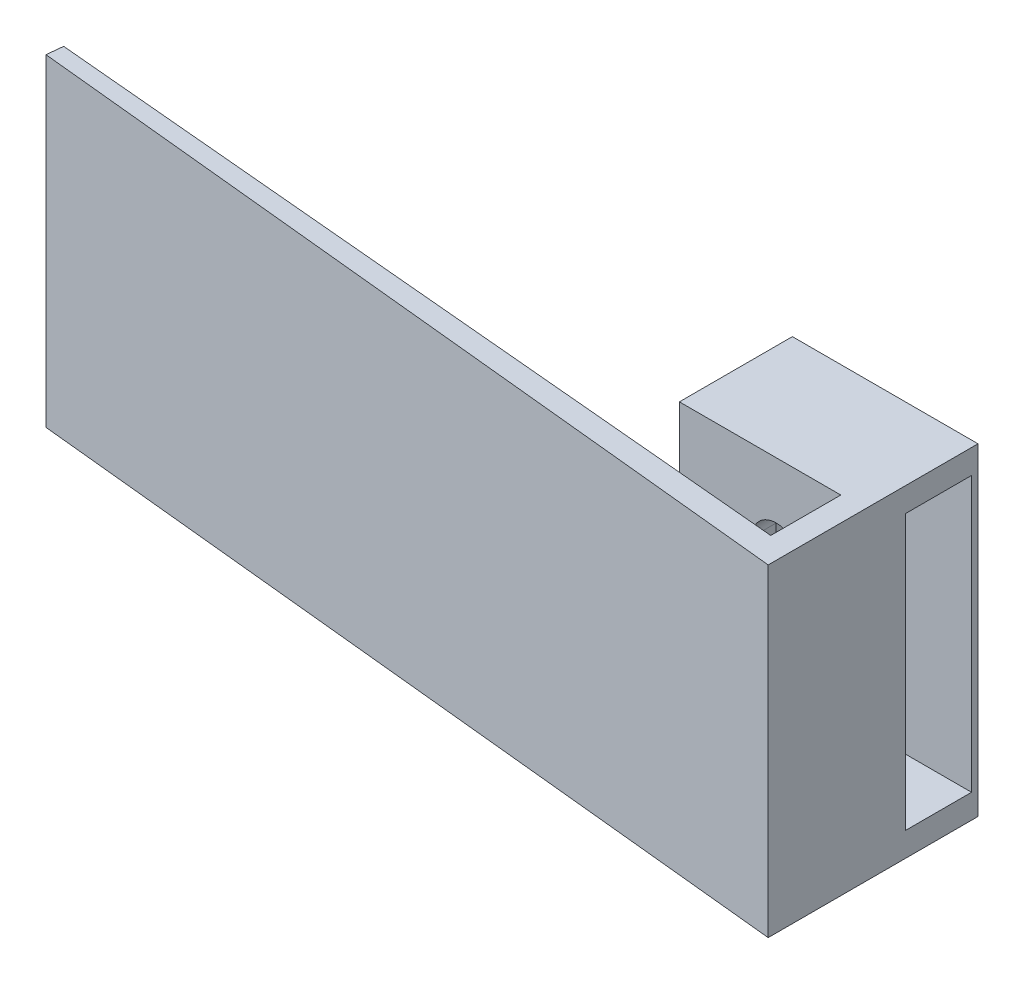
ISO-10303-21;
HEADER;
FILE_DESCRIPTION(('STEP AP214'),'2;1');
FILE_NAME('part.step','',(''),(''),'','','');
FILE_SCHEMA(('AUTOMOTIVE_DESIGN { 1 0 10303 214 1 1 1 1 }'));
ENDSEC;
DATA;
#1=APPLICATION_CONTEXT('core data for automotive mechanical design processes');
#2=APPLICATION_PROTOCOL_DEFINITION('international standard','automotive_design',2000,#1);
#3=PRODUCT_CONTEXT('',#1,'mechanical');
#4=PRODUCT('Part','Part','',(#3));
#5=PRODUCT_RELATED_PRODUCT_CATEGORY('part','',(#4));
#6=PRODUCT_DEFINITION_FORMATION('','',#4);
#7=PRODUCT_DEFINITION_CONTEXT('part definition',#1,'design');
#8=PRODUCT_DEFINITION('design','',#6,#7);
#9=PRODUCT_DEFINITION_SHAPE('','',#8);
#10=(LENGTH_UNIT() NAMED_UNIT(*) SI_UNIT(.MILLI.,.METRE.));
#11=(NAMED_UNIT(*) PLANE_ANGLE_UNIT() SI_UNIT($,.RADIAN.));
#12=(NAMED_UNIT(*) SI_UNIT($,.STERADIAN.) SOLID_ANGLE_UNIT());
#13=UNCERTAINTY_MEASURE_WITH_UNIT(LENGTH_MEASURE(1.E-05),#10,'distance_accuracy_value','');
#14=(GEOMETRIC_REPRESENTATION_CONTEXT(3) GLOBAL_UNCERTAINTY_ASSIGNED_CONTEXT((#13)) GLOBAL_UNIT_ASSIGNED_CONTEXT((#10,
#11,#12)) REPRESENTATION_CONTEXT('',''));
#15=CARTESIAN_POINT('',(0.,0.,0.));
#16=DIRECTION('',(0.,0.,1.));
#17=DIRECTION('',(1.,0.,0.));
#18=AXIS2_PLACEMENT_3D('',#15,#16,#17);
#19=CARTESIAN_POINT('',(0.,18.5,-7.5));
#20=DIRECTION('',(0.,1.,0.));
#21=DIRECTION('',(-1.,0.,0.));
#22=AXIS2_PLACEMENT_3D('',#19,#20,#21);
#23=PLANE('',#22);
#24=DIRECTION('',(1.,0.,0.));
#25=VECTOR('',#24,1.);
#26=CARTESIAN_POINT('',(-9.50000000013552,18.5000000000173,-12.6));
#27=LINE('',#26,#25);
#28=CARTESIAN_POINT('',(-9.5,18.5000000000173,-12.6));
#29=VERTEX_POINT('',#28);
#30=CARTESIAN_POINT('',(0.,18.5000000000173,-12.6));
#31=VERTEX_POINT('',#30);
#32=EDGE_CURVE('E162',#29,#31,#27,.T.);
#33=ORIENTED_EDGE('',*,*,#32,.T.);
#34=DIRECTION('',(0.,0.,-1.));
#35=VECTOR('',#34,1.);
#36=CARTESIAN_POINT('',(0.,18.5,-8.5));
#37=LINE('',#36,#35);
#38=CARTESIAN_POINT('',(0.,18.5,-8.5));
#39=VERTEX_POINT('',#38);
#40=EDGE_CURVE('E174',#39,#31,#37,.T.);
#41=ORIENTED_EDGE('',*,*,#40,.F.);
#42=DIRECTION('',(1.,0.,0.));
#43=VECTOR('',#42,1.);
#44=CARTESIAN_POINT('',(0.,18.5,-8.5));
#45=LINE('',#44,#43);
#46=CARTESIAN_POINT('',(-1.5,18.5,-8.5));
#47=VERTEX_POINT('',#46);
#48=EDGE_CURVE('E352',#47,#39,#45,.T.);
#49=ORIENTED_EDGE('',*,*,#48,.F.);
#50=DIRECTION('',(0.,0.,-1.));
#51=VECTOR('',#50,1.);
#52=CARTESIAN_POINT('',(-1.5,18.5,-7.5));
#53=LINE('',#52,#51);
#54=CARTESIAN_POINT('',(-1.5,18.5,-7.5));
#55=VERTEX_POINT('',#54);
#56=EDGE_CURVE('E200',#55,#47,#53,.T.);
#57=ORIENTED_EDGE('',*,*,#56,.F.);
#58=DIRECTION('',(1.,0.,0.));
#59=VECTOR('',#58,1.);
#60=CARTESIAN_POINT('',(0.,18.5,-7.5));
#61=LINE('',#60,#59);
#62=CARTESIAN_POINT('',(-9.5,18.5,-7.5));
#63=VERTEX_POINT('',#62);
#64=EDGE_CURVE('E196',#63,#55,#61,.T.);
#65=ORIENTED_EDGE('',*,*,#64,.F.);
#66=DIRECTION('',(0.,0.,-1.));
#67=VECTOR('',#66,1.);
#68=CARTESIAN_POINT('',(-9.5,18.5,-7.5));
#69=LINE('',#68,#67);
#70=EDGE_CURVE('E177',#63,#29,#69,.T.);
#71=ORIENTED_EDGE('',*,*,#70,.T.);
#72=EDGE_LOOP('',(#33,#41,#49,#57,#65,#71));
#73=FACE_BOUND('',#72,.T.);
#74=ADVANCED_FACE('F33',(#73),#23,.F.);
#75=CARTESIAN_POINT('',(-9.5,0.,-7.5));
#76=DIRECTION('',(-1.,0.,0.));
#77=DIRECTION('',(0.,0.,1.));
#78=AXIS2_PLACEMENT_3D('',#75,#76,#77);
#79=PLANE('',#78);
#80=DIRECTION('',(0.,-1.,0.));
#81=VECTOR('',#80,1.);
#82=CARTESIAN_POINT('',(-9.49999999991869,500000.,-12.6));
#83=LINE('',#82,#81);
#84=CARTESIAN_POINT('',(-9.5,1.5,-12.6));
#85=VERTEX_POINT('',#84);
#86=EDGE_CURVE('E170',#29,#85,#83,.T.);
#87=ORIENTED_EDGE('',*,*,#86,.F.);
#88=ORIENTED_EDGE('',*,*,#70,.F.);
#89=DIRECTION('',(0.,1.,0.));
#90=VECTOR('',#89,1.);
#91=CARTESIAN_POINT('',(-9.5,0.,-7.5));
#92=LINE('',#91,#90);
#93=CARTESIAN_POINT('',(-9.5,1.5,-7.5));
#94=VERTEX_POINT('',#93);
#95=EDGE_CURVE('E193',#94,#63,#92,.T.);
#96=ORIENTED_EDGE('',*,*,#95,.F.);
#97=DIRECTION('',(0.,0.,-1.));
#98=VECTOR('',#97,1.);
#99=CARTESIAN_POINT('',(-9.5,1.5,-7.5));
#100=LINE('',#99,#98);
#101=EDGE_CURVE('E205',#94,#85,#100,.T.);
#102=ORIENTED_EDGE('',*,*,#101,.T.);
#103=EDGE_LOOP('',(#87,#88,#96,#102));
#104=FACE_BOUND('',#103,.T.);
#105=ADVANCED_FACE('F312',(#104),#79,.F.);
#106=CARTESIAN_POINT('',(0.,1.5,-7.5));
#107=DIRECTION('',(0.,1.,0.));
#108=DIRECTION('',(-1.,0.,0.));
#109=AXIS2_PLACEMENT_3D('',#106,#107,#108);
#110=PLANE('',#109);
#111=DIRECTION('',(0.,0.,-1.));
#112=VECTOR('',#111,1.);
#113=CARTESIAN_POINT('',(0.,1.5,-8.5));
#114=LINE('',#113,#112);
#115=CARTESIAN_POINT('',(0.,1.5,-8.5));
#116=VERTEX_POINT('',#115);
#117=CARTESIAN_POINT('',(0.,1.5,-12.6));
#118=VERTEX_POINT('',#117);
#119=EDGE_CURVE('E183',#116,#118,#114,.T.);
#120=ORIENTED_EDGE('',*,*,#119,.T.);
#121=DIRECTION('',(1.,0.,0.));
#122=VECTOR('',#121,1.);
#123=CARTESIAN_POINT('',(-9.5,1.5,-12.6));
#124=LINE('',#123,#122);
#125=EDGE_CURVE('E165',#85,#118,#124,.T.);
#126=ORIENTED_EDGE('',*,*,#125,.F.);
#127=ORIENTED_EDGE('',*,*,#101,.F.);
#128=DIRECTION('',(1.,0.,0.));
#129=VECTOR('',#128,1.);
#130=CARTESIAN_POINT('',(0.,1.5,-7.5));
#131=LINE('',#130,#129);
#132=CARTESIAN_POINT('',(-1.5,1.5,-7.5));
#133=VERTEX_POINT('',#132);
#134=EDGE_CURVE('E191',#94,#133,#131,.T.);
#135=ORIENTED_EDGE('',*,*,#134,.T.);
#136=DIRECTION('',(0.,0.,-1.));
#137=VECTOR('',#136,1.);
#138=CARTESIAN_POINT('',(-1.5,1.5,-7.5));
#139=LINE('',#138,#137);
#140=CARTESIAN_POINT('',(-1.5,1.5,-8.5));
#141=VERTEX_POINT('',#140);
#142=EDGE_CURVE('E199',#133,#141,#139,.T.);
#143=ORIENTED_EDGE('',*,*,#142,.T.);
#144=DIRECTION('',(1.,0.,0.));
#145=VECTOR('',#144,1.);
#146=CARTESIAN_POINT('',(0.,1.5,-8.5));
#147=LINE('',#146,#145);
#148=EDGE_CURVE('E184',#141,#116,#147,.T.);
#149=ORIENTED_EDGE('',*,*,#148,.T.);
#150=EDGE_LOOP('',(#120,#126,#127,#135,#143,#149));
#151=FACE_BOUND('',#150,.T.);
#152=ADVANCED_FACE('F317',(#151),#110,.T.);
#153=CARTESIAN_POINT('',(-11.5,20.,-13.));
#154=DIRECTION('',(0.,0.,-1.));
#155=DIRECTION('',(-1.,0.,0.));
#156=AXIS2_PLACEMENT_3D('',#153,#154,#155);
#157=PLANE('',#156);
#158=DIRECTION('',(0.,-1.,0.));
#159=VECTOR('',#158,1.);
#160=CARTESIAN_POINT('',(0.,20.,-13.));
#161=LINE('',#160,#159);
#162=CARTESIAN_POINT('',(0.,20.,-13.));
#163=VERTEX_POINT('',#162);
#164=CARTESIAN_POINT('',(0.,0.,-13.));
#165=VERTEX_POINT('',#164);
#166=EDGE_CURVE('E37',#163,#165,#161,.T.);
#167=ORIENTED_EDGE('',*,*,#166,.T.);
#168=DIRECTION('',(1.,0.,0.));
#169=VECTOR('',#168,1.);
#170=CARTESIAN_POINT('',(-11.5,0.,-13.));
#171=LINE('',#170,#169);
#172=CARTESIAN_POINT('',(-11.5,0.,-13.));
#173=VERTEX_POINT('',#172);
#174=EDGE_CURVE('E203',#173,#165,#171,.T.);
#175=ORIENTED_EDGE('',*,*,#174,.F.);
#176=DIRECTION('',(0.,-1.,0.));
#177=VECTOR('',#176,1.);
#178=CARTESIAN_POINT('',(-11.5,20.,-13.));
#179=LINE('',#178,#177);
#180=CARTESIAN_POINT('',(-11.5,20.,-13.));
#181=VERTEX_POINT('',#180);
#182=EDGE_CURVE('E11',#181,#173,#179,.T.);
#183=ORIENTED_EDGE('',*,*,#182,.F.);
#184=DIRECTION('',(1.,0.,0.));
#185=VECTOR('',#184,1.);
#186=CARTESIAN_POINT('',(-11.5,20.,-13.));
#187=LINE('',#186,#185);
#188=EDGE_CURVE('E210',#181,#163,#187,.T.);
#189=ORIENTED_EDGE('',*,*,#188,.T.);
#190=EDGE_LOOP('',(#167,#175,#183,#189));
#191=FACE_BOUND('',#190,.T.);
#192=ADVANCED_FACE('F35',(#191),#157,.T.);
#193=CARTESIAN_POINT('',(0.,20.,-13.));
#194=DIRECTION('',(1.,0.,0.));
#195=DIRECTION('',(0.,0.,-1.));
#196=AXIS2_PLACEMENT_3D('',#193,#194,#195);
#197=PLANE('',#196);
#198=DIRECTION('',(0.,0.,1.));
#199=VECTOR('',#198,1.);
#200=CARTESIAN_POINT('',(0.,0.,-13.));
#201=LINE('',#200,#199);
#202=CARTESIAN_POINT('',(0.,0.,0.));
#203=VERTEX_POINT('',#202);
#204=EDGE_CURVE('E237',#165,#203,#201,.T.);
#205=ORIENTED_EDGE('',*,*,#204,.F.);
#206=ORIENTED_EDGE('',*,*,#166,.F.);
#207=DIRECTION('',(0.,0.,1.));
#208=VECTOR('',#207,1.);
#209=CARTESIAN_POINT('',(0.,20.,-13.));
#210=LINE('',#209,#208);
#211=CARTESIAN_POINT('',(0.,20.,0.));
#212=VERTEX_POINT('',#211);
#213=EDGE_CURVE('E213',#163,#212,#210,.T.);
#214=ORIENTED_EDGE('',*,*,#213,.T.);
#215=DIRECTION('',(0.,-1.,0.));
#216=VECTOR('',#215,1.);
#217=CARTESIAN_POINT('',(0.,20.,0.));
#218=LINE('',#217,#216);
#219=EDGE_CURVE('E265',#212,#203,#218,.T.);
#220=ORIENTED_EDGE('',*,*,#219,.T.);
#221=EDGE_LOOP('',(#205,#206,#214,#220));
#222=FACE_BOUND('',#221,.T.);
#223=ORIENTED_EDGE('',*,*,#40,.T.);
#224=DIRECTION('',(0.,-1.,0.));
#225=VECTOR('',#224,1.);
#226=CARTESIAN_POINT('',(8.1314918990924E-11,500000.,-12.6));
#227=LINE('',#226,#225);
#228=EDGE_CURVE('E159',#31,#118,#227,.T.);
#229=ORIENTED_EDGE('',*,*,#228,.T.);
#230=ORIENTED_EDGE('',*,*,#119,.F.);
#231=DIRECTION('',(0.,-1.,0.));
#232=VECTOR('',#231,1.);
#233=CARTESIAN_POINT('',(0.,0.,-8.5));
#234=LINE('',#233,#232);
#235=EDGE_CURVE('E182',#39,#116,#234,.T.);
#236=ORIENTED_EDGE('',*,*,#235,.F.);
#237=EDGE_LOOP('',(#223,#229,#230,#236));
#238=FACE_BOUND('',#237,.T.);
#239=ADVANCED_FACE('F180',(#222,#238),#197,.T.);
#240=CARTESIAN_POINT('',(-1.5,0.,-7.5));
#241=DIRECTION('',(-1.,0.,0.));
#242=DIRECTION('',(0.,0.,1.));
#243=AXIS2_PLACEMENT_3D('',#240,#241,#242);
#244=PLANE('',#243);
#245=ORIENTED_EDGE('',*,*,#56,.T.);
#246=DIRECTION('',(0.,1.,0.));
#247=VECTOR('',#246,1.);
#248=CARTESIAN_POINT('',(-1.5,0.,-8.5));
#249=LINE('',#248,#247);
#250=EDGE_CURVE('E354',#141,#47,#249,.T.);
#251=ORIENTED_EDGE('',*,*,#250,.F.);
#252=ORIENTED_EDGE('',*,*,#142,.F.);
#253=DIRECTION('',(0.,1.,0.));
#254=VECTOR('',#253,1.);
#255=CARTESIAN_POINT('',(-1.5,0.,-7.5));
#256=LINE('',#255,#254);
#257=EDGE_CURVE('E186',#133,#55,#256,.T.);
#258=ORIENTED_EDGE('',*,*,#257,.T.);
#259=EDGE_LOOP('',(#245,#251,#252,#258));
#260=FACE_BOUND('',#259,.T.);
#261=ADVANCED_FACE('F308',(#260),#244,.T.);
#262=CARTESIAN_POINT('',(-11.5,20.,-6.));
#263=DIRECTION('',(-1.,0.,0.));
#264=DIRECTION('',(0.,0.,1.));
#265=AXIS2_PLACEMENT_3D('',#262,#263,#264);
#266=PLANE('',#265);
#267=DIRECTION('',(0.,0.,-1.));
#268=VECTOR('',#267,1.);
#269=CARTESIAN_POINT('',(-11.5,0.,-6.));
#270=LINE('',#269,#268);
#271=CARTESIAN_POINT('',(-11.5,0.,-6.));
#272=VERTEX_POINT('',#271);
#273=EDGE_CURVE('E214',#272,#173,#270,.T.);
#274=ORIENTED_EDGE('',*,*,#273,.F.);
#275=DIRECTION('',(0.,-1.,0.));
#276=VECTOR('',#275,1.);
#277=CARTESIAN_POINT('',(-11.5,20.,-6.));
#278=LINE('',#277,#276);
#279=CARTESIAN_POINT('',(-11.5,20.,-6.));
#280=VERTEX_POINT('',#279);
#281=EDGE_CURVE('E42',#280,#272,#278,.T.);
#282=ORIENTED_EDGE('',*,*,#281,.F.);
#283=DIRECTION('',(0.,0.,-1.));
#284=VECTOR('',#283,1.);
#285=CARTESIAN_POINT('',(-11.5,20.,-6.));
#286=LINE('',#285,#284);
#287=EDGE_CURVE('E232',#280,#181,#286,.T.);
#288=ORIENTED_EDGE('',*,*,#287,.T.);
#289=ORIENTED_EDGE('',*,*,#182,.T.);
#290=EDGE_LOOP('',(#274,#282,#288,#289));
#291=FACE_BOUND('',#290,.T.);
#292=ADVANCED_FACE('F278',(#291),#266,.T.);
#293=CARTESIAN_POINT('',(-1.5,20.,-6.));
#294=DIRECTION('',(0.,0.,1.));
#295=DIRECTION('',(1.,0.,0.));
#296=AXIS2_PLACEMENT_3D('',#293,#294,#295);
#297=PLANE('',#296);
#298=CARTESIAN_POINT('',(-5.5,15.,-6.));
#299=DIRECTION('',(0.,0.,1.));
#300=DIRECTION('',(1.,0.,0.));
#301=AXIS2_PLACEMENT_3D('',#298,#299,#300);
#302=CIRCLE('',#301,1.5);
#303=CARTESIAN_POINT('',(-7.,15.,-6.));
#304=VERTEX_POINT('',#303);
#305=CARTESIAN_POINT('',(-4.,15.,-6.));
#306=VERTEX_POINT('',#305);
#307=EDGE_CURVE('E377',#304,#306,#302,.F.);
#308=ORIENTED_EDGE('',*,*,#307,.T.);
#309=DIRECTION('',(0.,-1.,0.));
#310=VECTOR('',#309,1.);
#311=CARTESIAN_POINT('',(-4.,15.,-6.));
#312=LINE('',#311,#310);
#313=CARTESIAN_POINT('',(-4.,5.,-6.));
#314=VERTEX_POINT('',#313);
#315=EDGE_CURVE('E368',#306,#314,#312,.T.);
#316=ORIENTED_EDGE('',*,*,#315,.T.);
#317=CARTESIAN_POINT('',(-5.5,5.,-6.));
#318=DIRECTION('',(0.,0.,1.));
#319=DIRECTION('',(1.,0.,0.));
#320=AXIS2_PLACEMENT_3D('',#317,#318,#319);
#321=CIRCLE('',#320,1.5);
#322=CARTESIAN_POINT('',(-7.,5.,-6.));
#323=VERTEX_POINT('',#322);
#324=EDGE_CURVE('E383',#314,#323,#321,.F.);
#325=ORIENTED_EDGE('',*,*,#324,.T.);
#326=DIRECTION('',(0.,1.,0.));
#327=VECTOR('',#326,1.);
#328=CARTESIAN_POINT('',(-7.,15.,-6.));
#329=LINE('',#328,#327);
#330=EDGE_CURVE('E379',#323,#304,#329,.T.);
#331=ORIENTED_EDGE('',*,*,#330,.T.);
#332=EDGE_LOOP('',(#308,#316,#325,#331));
#333=FACE_BOUND('',#332,.T.);
#334=DIRECTION('',(-1.,0.,0.));
#335=VECTOR('',#334,1.);
#336=CARTESIAN_POINT('',(-1.5,0.,-6.));
#337=LINE('',#336,#335);
#338=CARTESIAN_POINT('',(-1.5,0.,-6.));
#339=VERTEX_POINT('',#338);
#340=EDGE_CURVE('E252',#339,#272,#337,.T.);
#341=ORIENTED_EDGE('',*,*,#340,.F.);
#342=DIRECTION('',(0.,-1.,0.));
#343=VECTOR('',#342,1.);
#344=CARTESIAN_POINT('',(-1.5,20.,-6.));
#345=LINE('',#344,#343);
#346=CARTESIAN_POINT('',(-1.5,20.,-6.));
#347=VERTEX_POINT('',#346);
#348=EDGE_CURVE('E258',#347,#339,#345,.T.);
#349=ORIENTED_EDGE('',*,*,#348,.F.);
#350=DIRECTION('',(-1.,0.,0.));
#351=VECTOR('',#350,1.);
#352=CARTESIAN_POINT('',(-1.5,20.,-6.));
#353=LINE('',#352,#351);
#354=EDGE_CURVE('E229',#347,#280,#353,.T.);
#355=ORIENTED_EDGE('',*,*,#354,.T.);
#356=ORIENTED_EDGE('',*,*,#281,.T.);
#357=EDGE_LOOP('',(#341,#349,#355,#356));
#358=FACE_BOUND('',#357,.T.);
#359=ADVANCED_FACE('F299',(#333,#358),#297,.T.);
#360=CARTESIAN_POINT('',(-1.5,20.,-1.65848067099633));
#361=DIRECTION('',(-1.,0.,0.));
#362=DIRECTION('',(0.,0.,1.));
#363=AXIS2_PLACEMENT_3D('',#360,#361,#362);
#364=PLANE('',#363);
#365=DIRECTION('',(0.,0.,-1.));
#366=VECTOR('',#365,1.);
#367=CARTESIAN_POINT('',(-1.5,0.,-1.65848067099633));
#368=LINE('',#367,#366);
#369=CARTESIAN_POINT('',(-1.5,0.,-1.65848067099633));
#370=VERTEX_POINT('',#369);
#371=EDGE_CURVE('E249',#370,#339,#368,.T.);
#372=ORIENTED_EDGE('',*,*,#371,.F.);
#373=DIRECTION('',(0.,-1.,0.));
#374=VECTOR('',#373,1.);
#375=CARTESIAN_POINT('',(-1.5,20.,-1.65848067099633));
#376=LINE('',#375,#374);
#377=CARTESIAN_POINT('',(-1.5,20.,-1.65848067099633));
#378=VERTEX_POINT('',#377);
#379=EDGE_CURVE('E260',#378,#370,#376,.T.);
#380=ORIENTED_EDGE('',*,*,#379,.F.);
#381=DIRECTION('',(0.,0.,-1.));
#382=VECTOR('',#381,1.);
#383=CARTESIAN_POINT('',(-1.5,20.,-1.65848067099633));
#384=LINE('',#383,#382);
#385=EDGE_CURVE('E226',#378,#347,#384,.T.);
#386=ORIENTED_EDGE('',*,*,#385,.T.);
#387=ORIENTED_EDGE('',*,*,#348,.T.);
#388=EDGE_LOOP('',(#372,#380,#386,#387));
#389=FACE_BOUND('',#388,.T.);
#390=ADVANCED_FACE('F297',(#389),#364,.T.);
#391=CARTESIAN_POINT('',(-49.6487663492256,20.,-6.));
#392=DIRECTION('',(0.0898045237659601,0.,-0.99595941057413));
#393=DIRECTION('',(-0.99595941057413,0.,-0.0898045237659601));
#394=AXIS2_PLACEMENT_3D('',#391,#392,#393);
#395=PLANE('',#394);
#396=DIRECTION('',(0.99595941057413,0.,0.0898045237659601));
#397=VECTOR('',#396,1.);
#398=CARTESIAN_POINT('',(-49.6487663492256,0.,-6.));
#399=LINE('',#398,#397);
#400=CARTESIAN_POINT('',(-49.6487663492256,0.,-6.));
#401=VERTEX_POINT('',#400);
#402=EDGE_CURVE('E246',#401,#370,#399,.T.);
#403=ORIENTED_EDGE('',*,*,#402,.F.);
#404=DIRECTION('',(0.,-1.,0.));
#405=VECTOR('',#404,1.);
#406=CARTESIAN_POINT('',(-49.6487663492256,20.,-6.));
#407=LINE('',#406,#405);
#408=CARTESIAN_POINT('',(-49.6487663492256,20.,-6.));
#409=VERTEX_POINT('',#408);
#410=EDGE_CURVE('E262',#409,#401,#407,.T.);
#411=ORIENTED_EDGE('',*,*,#410,.F.);
#412=DIRECTION('',(0.99595941057413,0.,0.0898045237659601));
#413=VECTOR('',#412,1.);
#414=CARTESIAN_POINT('',(-49.6487663492256,20.,-6.));
#415=LINE('',#414,#413);
#416=EDGE_CURVE('E223',#409,#378,#415,.T.);
#417=ORIENTED_EDGE('',*,*,#416,.T.);
#418=ORIENTED_EDGE('',*,*,#379,.T.);
#419=EDGE_LOOP('',(#403,#411,#417,#418));
#420=FACE_BOUND('',#419,.T.);
#421=ADVANCED_FACE('F293',(#420),#395,.T.);
#422=CARTESIAN_POINT('',(-49.7488668025047,20.,-5.00502266394991));
#423=DIRECTION('',(-0.994977336050092,0.,-0.100100453279004));
#424=DIRECTION('',(-0.100100453279004,0.,0.994977336050092));
#425=AXIS2_PLACEMENT_3D('',#422,#423,#424);
#426=PLANE('',#425);
#427=DIRECTION('',(0.100100453279004,0.,-0.994977336050092));
#428=VECTOR('',#427,1.);
#429=CARTESIAN_POINT('',(-49.7488668025047,0.,-5.00502266394991));
#430=LINE('',#429,#428);
#431=CARTESIAN_POINT('',(-49.7488668025047,0.,-5.00502266394991));
#432=VERTEX_POINT('',#431);
#433=EDGE_CURVE('E243',#432,#401,#430,.T.);
#434=ORIENTED_EDGE('',*,*,#433,.F.);
#435=DIRECTION('',(0.,-1.,0.));
#436=VECTOR('',#435,1.);
#437=CARTESIAN_POINT('',(-49.7488668025047,20.,-5.00502266394991));
#438=LINE('',#437,#436);
#439=CARTESIAN_POINT('',(-49.7488668025047,20.,-5.00502266394991));
#440=VERTEX_POINT('',#439);
#441=EDGE_CURVE('E264',#440,#432,#438,.T.);
#442=ORIENTED_EDGE('',*,*,#441,.F.);
#443=DIRECTION('',(0.100100453279004,0.,-0.994977336050092));
#444=VECTOR('',#443,1.);
#445=CARTESIAN_POINT('',(-49.7488668025047,20.,-5.00502266394991));
#446=LINE('',#445,#444);
#447=EDGE_CURVE('E220',#440,#409,#446,.T.);
#448=ORIENTED_EDGE('',*,*,#447,.T.);
#449=ORIENTED_EDGE('',*,*,#410,.T.);
#450=EDGE_LOOP('',(#434,#442,#448,#449));
#451=FACE_BOUND('',#450,.T.);
#452=ADVANCED_FACE('F291',(#451),#426,.T.);
#453=CARTESIAN_POINT('',(0.,20.,0.));
#454=DIRECTION('',(-0.100100453278998,0.,0.994977336050093));
#455=DIRECTION('',(0.994977336050093,0.,0.100100453278998));
#456=AXIS2_PLACEMENT_3D('',#453,#454,#455);
#457=PLANE('',#456);
#458=DIRECTION('',(-0.994977336050093,0.,-0.100100453278998));
#459=VECTOR('',#458,1.);
#460=CARTESIAN_POINT('',(0.,0.,0.));
#461=LINE('',#460,#459);
#462=EDGE_CURVE('E240',#203,#432,#461,.T.);
#463=ORIENTED_EDGE('',*,*,#462,.F.);
#464=ORIENTED_EDGE('',*,*,#219,.F.);
#465=DIRECTION('',(-0.994977336050093,0.,-0.100100453278998));
#466=VECTOR('',#465,1.);
#467=CARTESIAN_POINT('',(0.,20.,0.));
#468=LINE('',#467,#466);
#469=EDGE_CURVE('E217',#212,#440,#468,.T.);
#470=ORIENTED_EDGE('',*,*,#469,.T.);
#471=ORIENTED_EDGE('',*,*,#441,.T.);
#472=EDGE_LOOP('',(#463,#464,#470,#471));
#473=FACE_BOUND('',#472,.T.);
#474=ADVANCED_FACE('F287',(#473),#457,.T.);
#475=CARTESIAN_POINT('',(0.,20.,0.));
#476=DIRECTION('',(0.,-1.,0.));
#477=DIRECTION('',(0.,0.,-1.));
#478=AXIS2_PLACEMENT_3D('',#475,#476,#477);
#479=PLANE('',#478);
#480=ORIENTED_EDGE('',*,*,#188,.F.);
#481=ORIENTED_EDGE('',*,*,#287,.F.);
#482=ORIENTED_EDGE('',*,*,#354,.F.);
#483=ORIENTED_EDGE('',*,*,#385,.F.);
#484=ORIENTED_EDGE('',*,*,#416,.F.);
#485=ORIENTED_EDGE('',*,*,#447,.F.);
#486=ORIENTED_EDGE('',*,*,#469,.F.);
#487=ORIENTED_EDGE('',*,*,#213,.F.);
#488=EDGE_LOOP('',(#480,#481,#482,#483,#484,#485,#486,#487));
#489=FACE_BOUND('',#488,.T.);
#490=ADVANCED_FACE('F281',(#489),#479,.F.);
#491=CARTESIAN_POINT('',(0.,0.,0.));
#492=DIRECTION('',(0.,-1.,0.));
#493=DIRECTION('',(0.,0.,-1.));
#494=AXIS2_PLACEMENT_3D('',#491,#492,#493);
#495=PLANE('',#494);
#496=ORIENTED_EDGE('',*,*,#174,.T.);
#497=ORIENTED_EDGE('',*,*,#204,.T.);
#498=ORIENTED_EDGE('',*,*,#462,.T.);
#499=ORIENTED_EDGE('',*,*,#433,.T.);
#500=ORIENTED_EDGE('',*,*,#402,.T.);
#501=ORIENTED_EDGE('',*,*,#371,.T.);
#502=ORIENTED_EDGE('',*,*,#340,.T.);
#503=ORIENTED_EDGE('',*,*,#273,.T.);
#504=EDGE_LOOP('',(#496,#497,#498,#499,#500,#501,#502,#503));
#505=FACE_BOUND('',#504,.T.);
#506=ADVANCED_FACE('F274',(#505),#495,.T.);
#507=CARTESIAN_POINT('',(0.,0.,-7.5));
#508=DIRECTION('',(0.,0.,-1.));
#509=DIRECTION('',(-1.,0.,0.));
#510=AXIS2_PLACEMENT_3D('',#507,#508,#509);
#511=PLANE('',#510);
#512=CARTESIAN_POINT('',(-5.5,15.,-7.5));
#513=DIRECTION('',(0.,0.,-1.));
#514=DIRECTION('',(-1.,0.,0.));
#515=AXIS2_PLACEMENT_3D('',#512,#513,#514);
#516=CIRCLE('',#515,1.5);
#517=CARTESIAN_POINT('',(-7.,15.,-7.5));
#518=VERTEX_POINT('',#517);
#519=CARTESIAN_POINT('',(-4.,15.,-7.5));
#520=VERTEX_POINT('',#519);
#521=EDGE_CURVE('E58',#518,#520,#516,.T.);
#522=ORIENTED_EDGE('',*,*,#521,.F.);
#523=DIRECTION('',(0.,1.,0.));
#524=VECTOR('',#523,1.);
#525=CARTESIAN_POINT('',(-7.,15.,-7.5));
#526=LINE('',#525,#524);
#527=CARTESIAN_POINT('',(-7.,5.,-7.5));
#528=VERTEX_POINT('',#527);
#529=EDGE_CURVE('E356',#528,#518,#526,.T.);
#530=ORIENTED_EDGE('',*,*,#529,.F.);
#531=CARTESIAN_POINT('',(-5.5,5.,-7.5));
#532=DIRECTION('',(0.,0.,-1.));
#533=DIRECTION('',(-1.,0.,0.));
#534=AXIS2_PLACEMENT_3D('',#531,#532,#533);
#535=CIRCLE('',#534,1.5);
#536=CARTESIAN_POINT('',(-4.,5.,-7.5));
#537=VERTEX_POINT('',#536);
#538=EDGE_CURVE('E359',#537,#528,#535,.T.);
#539=ORIENTED_EDGE('',*,*,#538,.F.);
#540=DIRECTION('',(0.,-1.,0.));
#541=VECTOR('',#540,1.);
#542=CARTESIAN_POINT('',(-4.,15.,-7.5));
#543=LINE('',#542,#541);
#544=EDGE_CURVE('E374',#520,#537,#543,.T.);
#545=ORIENTED_EDGE('',*,*,#544,.F.);
#546=EDGE_LOOP('',(#522,#530,#539,#545));
#547=FACE_BOUND('',#546,.T.);
#548=ORIENTED_EDGE('',*,*,#257,.F.);
#549=ORIENTED_EDGE('',*,*,#134,.F.);
#550=ORIENTED_EDGE('',*,*,#95,.T.);
#551=ORIENTED_EDGE('',*,*,#64,.T.);
#552=EDGE_LOOP('',(#548,#549,#550,#551));
#553=FACE_BOUND('',#552,.T.);
#554=ADVANCED_FACE('F321',(#547,#553),#511,.T.);
#555=CARTESIAN_POINT('',(0.,0.,-8.5));
#556=DIRECTION('',(0.,0.,-1.));
#557=DIRECTION('',(-1.,0.,0.));
#558=AXIS2_PLACEMENT_3D('',#555,#556,#557);
#559=PLANE('',#558);
#560=ORIENTED_EDGE('',*,*,#250,.T.);
#561=ORIENTED_EDGE('',*,*,#48,.T.);
#562=ORIENTED_EDGE('',*,*,#235,.T.);
#563=ORIENTED_EDGE('',*,*,#148,.F.);
#564=EDGE_LOOP('',(#560,#561,#562,#563));
#565=FACE_BOUND('',#564,.T.);
#566=ADVANCED_FACE('F336',(#565),#559,.T.);
#567=CARTESIAN_POINT('',(-5.5,15.,0.00100000000000013));
#568=DIRECTION('',(0.,0.,-1.));
#569=DIRECTION('',(-1.,0.,0.));
#570=AXIS2_PLACEMENT_3D('',#567,#568,#569);
#571=CYLINDRICAL_SURFACE('',#570,1.5);
#572=DIRECTION('',(0.,0.,-1.));
#573=VECTOR('',#572,1.);
#574=CARTESIAN_POINT('',(-7.,15.,0.00100000000000013));
#575=LINE('',#574,#573);
#576=EDGE_CURVE('E382',#304,#518,#575,.T.);
#577=ORIENTED_EDGE('',*,*,#576,.T.);
#578=ORIENTED_EDGE('',*,*,#521,.T.);
#579=DIRECTION('',(0.,0.,-1.));
#580=VECTOR('',#579,1.);
#581=CARTESIAN_POINT('',(-4.,15.,0.00100000000000013));
#582=LINE('',#581,#580);
#583=EDGE_CURVE('E362',#306,#520,#582,.T.);
#584=ORIENTED_EDGE('',*,*,#583,.F.);
#585=ORIENTED_EDGE('',*,*,#307,.F.);
#586=EDGE_LOOP('',(#577,#578,#584,#585));
#587=FACE_BOUND('',#586,.T.);
#588=ADVANCED_FACE('F341',(#587),#571,.F.);
#589=CARTESIAN_POINT('',(-7.,15.,0.00100000000000013));
#590=DIRECTION('',(-1.,0.,0.));
#591=DIRECTION('',(0.,0.,1.));
#592=AXIS2_PLACEMENT_3D('',#589,#590,#591);
#593=PLANE('',#592);
#594=DIRECTION('',(0.,0.,-1.));
#595=VECTOR('',#594,1.);
#596=CARTESIAN_POINT('',(-7.,5.,0.00100000000000013));
#597=LINE('',#596,#595);
#598=EDGE_CURVE('E370',#323,#528,#597,.T.);
#599=ORIENTED_EDGE('',*,*,#598,.T.);
#600=ORIENTED_EDGE('',*,*,#529,.T.);
#601=ORIENTED_EDGE('',*,*,#576,.F.);
#602=ORIENTED_EDGE('',*,*,#330,.F.);
#603=EDGE_LOOP('',(#599,#600,#601,#602));
#604=FACE_BOUND('',#603,.T.);
#605=ADVANCED_FACE('F394',(#604),#593,.F.);
#606=CARTESIAN_POINT('',(-5.5,5.,0.00100000000000013));
#607=DIRECTION('',(0.,0.,-1.));
#608=DIRECTION('',(-1.,0.,0.));
#609=AXIS2_PLACEMENT_3D('',#606,#607,#608);
#610=CYLINDRICAL_SURFACE('',#609,1.5);
#611=DIRECTION('',(0.,0.,-1.));
#612=VECTOR('',#611,1.);
#613=CARTESIAN_POINT('',(-4.,5.,0.00100000000000013));
#614=LINE('',#613,#612);
#615=EDGE_CURVE('E50',#314,#537,#614,.T.);
#616=ORIENTED_EDGE('',*,*,#615,.T.);
#617=ORIENTED_EDGE('',*,*,#538,.T.);
#618=ORIENTED_EDGE('',*,*,#598,.F.);
#619=ORIENTED_EDGE('',*,*,#324,.F.);
#620=EDGE_LOOP('',(#616,#617,#618,#619));
#621=FACE_BOUND('',#620,.T.);
#622=ADVANCED_FACE('F388',(#621),#610,.F.);
#623=CARTESIAN_POINT('',(-4.,15.,0.00100000000000013));
#624=DIRECTION('',(1.,0.,0.));
#625=DIRECTION('',(0.,0.,-1.));
#626=AXIS2_PLACEMENT_3D('',#623,#624,#625);
#627=PLANE('',#626);
#628=ORIENTED_EDGE('',*,*,#583,.T.);
#629=ORIENTED_EDGE('',*,*,#544,.T.);
#630=ORIENTED_EDGE('',*,*,#615,.F.);
#631=ORIENTED_EDGE('',*,*,#315,.F.);
#632=EDGE_LOOP('',(#628,#629,#630,#631));
#633=FACE_BOUND('',#632,.T.);
#634=ADVANCED_FACE('F391',(#633),#627,.F.);
#635=CARTESIAN_POINT('',(-9.49999999991869,500000.,-12.6));
#636=DIRECTION('',(0.,0.,-1.));
#637=DIRECTION('',(-1.,0.,0.));
#638=AXIS2_PLACEMENT_3D('',#635,#636,#637);
#639=PLANE('',#638);
#640=ORIENTED_EDGE('',*,*,#32,.F.);
#641=ORIENTED_EDGE('',*,*,#86,.T.);
#642=ORIENTED_EDGE('',*,*,#125,.T.);
#643=ORIENTED_EDGE('',*,*,#228,.F.);
#644=EDGE_LOOP('',(#640,#641,#642,#643));
#645=FACE_BOUND('',#644,.T.);
#646=ADVANCED_FACE('F161',(#645),#639,.F.);
#647=CLOSED_SHELL('',(#74,#105,#152,#192,#239,#261,#292,#359,#390,#421,#452,#474,#490,#506,#554,
#566,#588,#605,#622,#634,#646));
#648=MANIFOLD_SOLID_BREP('B2',#647);
#649=ADVANCED_BREP_SHAPE_REPRESENTATION('',(#18,#648),#14);
#650=SHAPE_DEFINITION_REPRESENTATION(#9,#649);
ENDSEC;
END-ISO-10303-21;
